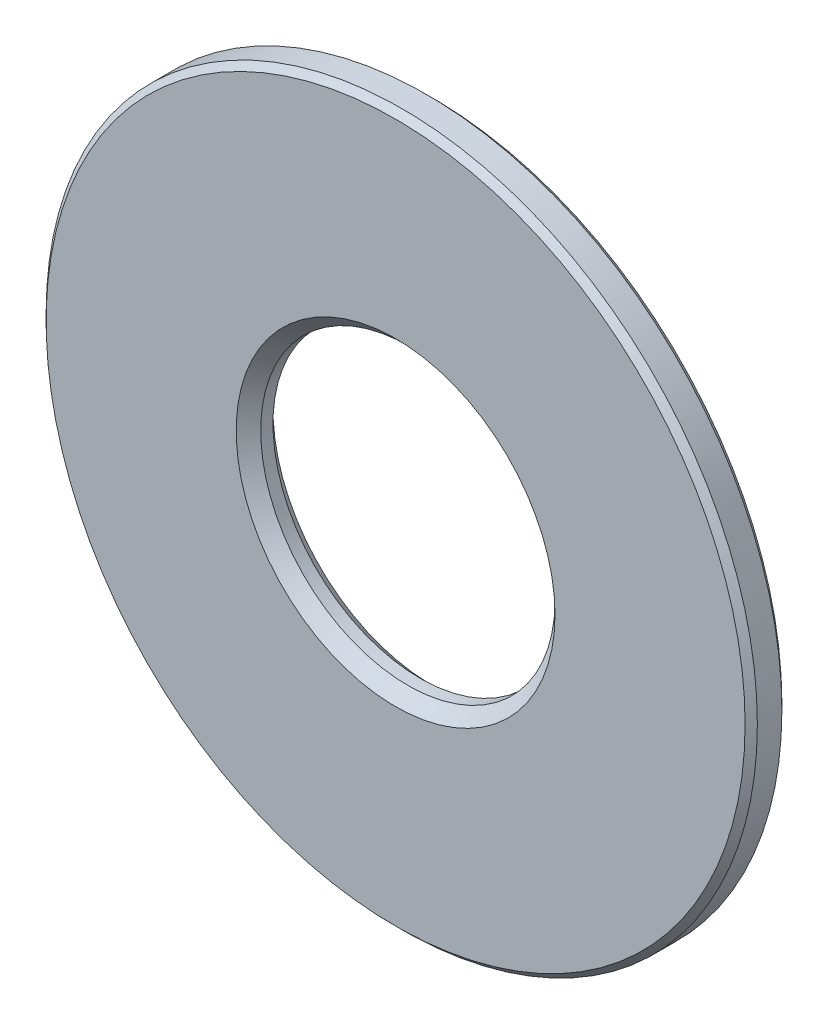
ISO-10303-21;
HEADER;
FILE_DESCRIPTION(('STEP AP214'),'2;1');
FILE_NAME('part.step','',(''),(''),'','','');
FILE_SCHEMA(('AUTOMOTIVE_DESIGN { 1 0 10303 214 1 1 1 1 }'));
ENDSEC;
DATA;
#1=APPLICATION_CONTEXT('core data for automotive mechanical design processes');
#2=APPLICATION_PROTOCOL_DEFINITION('international standard','automotive_design',2000,#1);
#3=PRODUCT_CONTEXT('',#1,'mechanical');
#4=PRODUCT('Part','Part','',(#3));
#5=PRODUCT_RELATED_PRODUCT_CATEGORY('part','',(#4));
#6=PRODUCT_DEFINITION_FORMATION('','',#4);
#7=PRODUCT_DEFINITION_CONTEXT('part definition',#1,'design');
#8=PRODUCT_DEFINITION('design','',#6,#7);
#9=PRODUCT_DEFINITION_SHAPE('','',#8);
#10=(LENGTH_UNIT() NAMED_UNIT(*) SI_UNIT(.MILLI.,.METRE.));
#11=(NAMED_UNIT(*) PLANE_ANGLE_UNIT() SI_UNIT($,.RADIAN.));
#12=(NAMED_UNIT(*) SI_UNIT($,.STERADIAN.) SOLID_ANGLE_UNIT());
#13=UNCERTAINTY_MEASURE_WITH_UNIT(LENGTH_MEASURE(1.E-05),#10,'distance_accuracy_value','');
#14=(GEOMETRIC_REPRESENTATION_CONTEXT(3) GLOBAL_UNCERTAINTY_ASSIGNED_CONTEXT((#13)) GLOBAL_UNIT_ASSIGNED_CONTEXT((#10,
#11,#12)) REPRESENTATION_CONTEXT('',''));
#15=CARTESIAN_POINT('',(0.,0.,0.));
#16=DIRECTION('',(0.,0.,1.));
#17=DIRECTION('',(1.,0.,0.));
#18=AXIS2_PLACEMENT_3D('',#15,#16,#17);
#19=CARTESIAN_POINT('',(0.,0.,3.));
#20=DIRECTION('',(0.,0.,1.));
#21=DIRECTION('',(1.,0.,0.));
#22=AXIS2_PLACEMENT_3D('',#19,#20,#21);
#23=PLANE('',#22);
#24=CARTESIAN_POINT('',(0.,0.,3.));
#25=DIRECTION('',(0.,0.,1.));
#26=DIRECTION('',(1.,0.,0.));
#27=AXIS2_PLACEMENT_3D('',#24,#25,#26);
#28=CIRCLE('',#27,28.5);
#29=CARTESIAN_POINT('',(28.5,0.,3.));
#30=VERTEX_POINT('',#29);
#31=EDGE_CURVE('E10',#30,#30,#28,.T.);
#32=ORIENTED_EDGE('',*,*,#31,.T.);
#33=EDGE_LOOP('',(#32));
#34=FACE_BOUND('',#33,.T.);
#35=CARTESIAN_POINT('',(0.,0.,3.));
#36=DIRECTION('',(0.,0.,1.));
#37=DIRECTION('',(1.,0.,0.));
#38=AXIS2_PLACEMENT_3D('',#35,#36,#37);
#39=CIRCLE('',#38,13.);
#40=CARTESIAN_POINT('',(13.,0.,3.));
#41=VERTEX_POINT('',#40);
#42=EDGE_CURVE('E59',#41,#41,#39,.F.);
#43=ORIENTED_EDGE('',*,*,#42,.T.);
#44=EDGE_LOOP('',(#43));
#45=FACE_BOUND('',#44,.T.);
#46=ADVANCED_FACE('F38',(#34,#45),#23,.T.);
#47=CARTESIAN_POINT('',(0.,0.,0.));
#48=DIRECTION('',(0.,0.,1.));
#49=DIRECTION('',(1.,0.,0.));
#50=AXIS2_PLACEMENT_3D('',#47,#48,#49);
#51=PLANE('',#50);
#52=CARTESIAN_POINT('',(0.,0.,0.));
#53=DIRECTION('',(0.,0.,1.));
#54=DIRECTION('',(1.,0.,0.));
#55=AXIS2_PLACEMENT_3D('',#52,#53,#54);
#56=CIRCLE('',#55,28.5);
#57=CARTESIAN_POINT('',(28.5,0.,0.));
#58=VERTEX_POINT('',#57);
#59=EDGE_CURVE('E46',#58,#58,#56,.F.);
#60=ORIENTED_EDGE('',*,*,#59,.T.);
#61=EDGE_LOOP('',(#60));
#62=FACE_BOUND('',#61,.T.);
#63=CARTESIAN_POINT('',(0.,0.,0.));
#64=DIRECTION('',(0.,0.,1.));
#65=DIRECTION('',(1.,0.,0.));
#66=AXIS2_PLACEMENT_3D('',#63,#64,#65);
#67=CIRCLE('',#66,13.);
#68=CARTESIAN_POINT('',(13.,0.,0.));
#69=VERTEX_POINT('',#68);
#70=EDGE_CURVE('E68',#69,#69,#67,.T.);
#71=ORIENTED_EDGE('',*,*,#70,.T.);
#72=EDGE_LOOP('',(#71));
#73=FACE_BOUND('',#72,.T.);
#74=ADVANCED_FACE('F72',(#62,#73),#51,.F.);
#75=CARTESIAN_POINT('',(0.,0.,3.));
#76=DIRECTION('',(0.,0.,-1.));
#77=DIRECTION('',(-1.,0.,0.));
#78=AXIS2_PLACEMENT_3D('',#75,#76,#77);
#79=CYLINDRICAL_SURFACE('',#78,29.);
#80=CARTESIAN_POINT('',(0.,0.,0.499999999999997));
#81=DIRECTION('',(0.,0.,1.));
#82=DIRECTION('',(1.,0.,0.));
#83=AXIS2_PLACEMENT_3D('',#80,#81,#82);
#84=CIRCLE('',#83,29.);
#85=CARTESIAN_POINT('',(29.,0.,0.499999999999997));
#86=VERTEX_POINT('',#85);
#87=EDGE_CURVE('E50',#86,#86,#84,.T.);
#88=ORIENTED_EDGE('',*,*,#87,.T.);
#89=EDGE_LOOP('',(#88));
#90=FACE_BOUND('',#89,.T.);
#91=CARTESIAN_POINT('',(0.,0.,2.50000000000001));
#92=DIRECTION('',(0.,0.,1.));
#93=DIRECTION('',(1.,0.,0.));
#94=AXIS2_PLACEMENT_3D('',#91,#92,#93);
#95=CIRCLE('',#94,29.);
#96=CARTESIAN_POINT('',(29.,0.,2.50000000000001));
#97=VERTEX_POINT('',#96);
#98=EDGE_CURVE('E54',#97,#97,#95,.F.);
#99=ORIENTED_EDGE('',*,*,#98,.T.);
#100=EDGE_LOOP('',(#99));
#101=FACE_BOUND('',#100,.T.);
#102=ADVANCED_FACE('F87',(#90,#101),#79,.T.);
#103=CARTESIAN_POINT('',(0.,0.,3.));
#104=DIRECTION('',(0.,0.,-1.));
#105=DIRECTION('',(-1.,0.,0.));
#106=AXIS2_PLACEMENT_3D('',#103,#104,#105);
#107=CYLINDRICAL_SURFACE('',#106,12.);
#108=CARTESIAN_POINT('',(0.,0.,1.));
#109=DIRECTION('',(0.,0.,1.));
#110=DIRECTION('',(1.,0.,0.));
#111=AXIS2_PLACEMENT_3D('',#108,#109,#110);
#112=CIRCLE('',#111,12.);
#113=CARTESIAN_POINT('',(12.,0.,1.));
#114=VERTEX_POINT('',#113);
#115=EDGE_CURVE('E62',#114,#114,#112,.F.);
#116=ORIENTED_EDGE('',*,*,#115,.T.);
#117=EDGE_LOOP('',(#116));
#118=FACE_BOUND('',#117,.T.);
#119=CARTESIAN_POINT('',(0.,0.,2.));
#120=DIRECTION('',(0.,0.,1.));
#121=DIRECTION('',(1.,0.,0.));
#122=AXIS2_PLACEMENT_3D('',#119,#120,#121);
#123=CIRCLE('',#122,12.);
#124=CARTESIAN_POINT('',(12.,0.,2.));
#125=VERTEX_POINT('',#124);
#126=EDGE_CURVE('E65',#125,#125,#123,.T.);
#127=ORIENTED_EDGE('',*,*,#126,.T.);
#128=EDGE_LOOP('',(#127));
#129=FACE_BOUND('',#128,.T.);
#130=ADVANCED_FACE('F77',(#118,#129),#107,.F.);
#131=CARTESIAN_POINT('',(0.,0.,0.));
#132=DIRECTION('',(0.,0.,-1.));
#133=DIRECTION('',(-1.,0.,0.));
#134=AXIS2_PLACEMENT_3D('',#131,#132,#133);
#135=CONICAL_SURFACE('',#134,13.,0.785398163397446);
#136=ORIENTED_EDGE('',*,*,#115,.F.);
#137=EDGE_LOOP('',(#136));
#138=FACE_BOUND('',#137,.T.);
#139=ORIENTED_EDGE('',*,*,#70,.F.);
#140=EDGE_LOOP('',(#139));
#141=FACE_BOUND('',#140,.T.);
#142=ADVANCED_FACE('F74',(#138,#141),#135,.F.);
#143=CARTESIAN_POINT('',(0.,0.,2.));
#144=DIRECTION('',(0.,0.,1.));
#145=DIRECTION('',(1.,0.,0.));
#146=AXIS2_PLACEMENT_3D('',#143,#144,#145);
#147=CONICAL_SURFACE('',#146,12.,0.785398163397448);
#148=ORIENTED_EDGE('',*,*,#42,.F.);
#149=EDGE_LOOP('',(#148));
#150=FACE_BOUND('',#149,.T.);
#151=ORIENTED_EDGE('',*,*,#126,.F.);
#152=EDGE_LOOP('',(#151));
#153=FACE_BOUND('',#152,.T.);
#154=ADVANCED_FACE('F76',(#150,#153),#147,.F.);
#155=CARTESIAN_POINT('',(0.,0.,0.499999999999997));
#156=DIRECTION('',(0.,0.,1.));
#157=DIRECTION('',(1.,0.,0.));
#158=AXIS2_PLACEMENT_3D('',#155,#156,#157);
#159=CONICAL_SURFACE('',#158,29.,0.785398163397455);
#160=ORIENTED_EDGE('',*,*,#59,.F.);
#161=EDGE_LOOP('',(#160));
#162=FACE_BOUND('',#161,.T.);
#163=ORIENTED_EDGE('',*,*,#87,.F.);
#164=EDGE_LOOP('',(#163));
#165=FACE_BOUND('',#164,.T.);
#166=ADVANCED_FACE('F84',(#162,#165),#159,.T.);
#167=CARTESIAN_POINT('',(0.,0.,3.));
#168=DIRECTION('',(0.,0.,-1.));
#169=DIRECTION('',(-1.,0.,0.));
#170=AXIS2_PLACEMENT_3D('',#167,#168,#169);
#171=CONICAL_SURFACE('',#170,28.5,0.785398163397441);
#172=ORIENTED_EDGE('',*,*,#98,.F.);
#173=EDGE_LOOP('',(#172));
#174=FACE_BOUND('',#173,.T.);
#175=ORIENTED_EDGE('',*,*,#31,.F.);
#176=EDGE_LOOP('',(#175));
#177=FACE_BOUND('',#176,.T.);
#178=ADVANCED_FACE('F41',(#174,#177),#171,.T.);
#179=CLOSED_SHELL('',(#46,#74,#102,#130,#142,#154,#166,#178));
#180=MANIFOLD_SOLID_BREP('B2',#179);
#181=ADVANCED_BREP_SHAPE_REPRESENTATION('',(#18,#180),#14);
#182=SHAPE_DEFINITION_REPRESENTATION(#9,#181);
ENDSEC;
END-ISO-10303-21;
